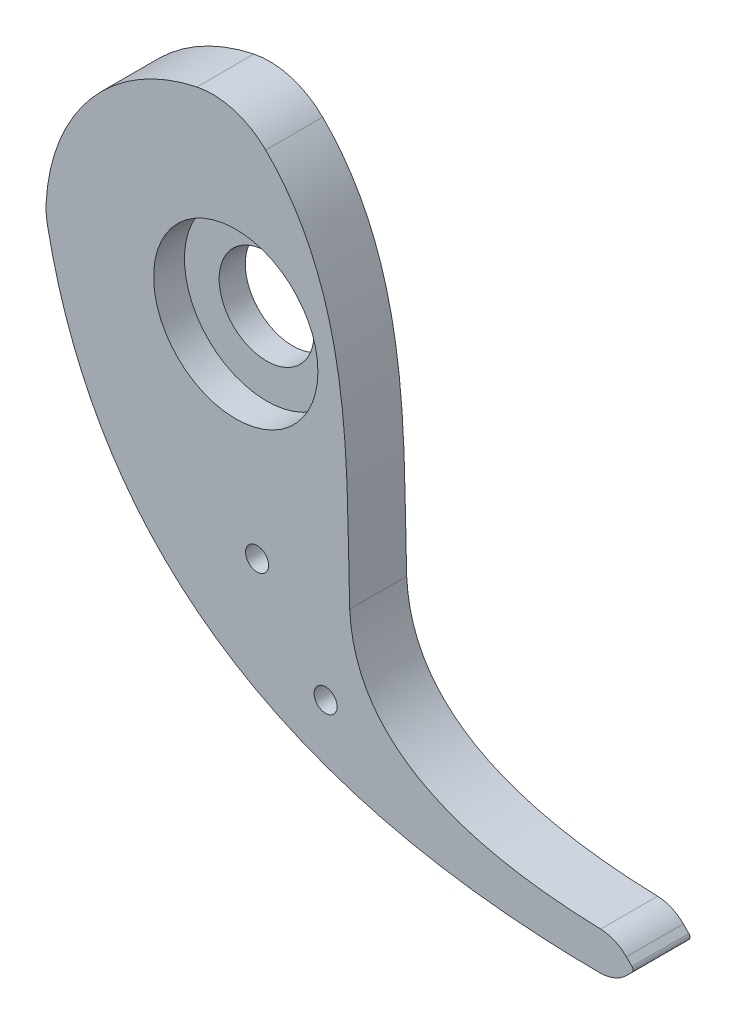
ISO-10303-21;
HEADER;
FILE_DESCRIPTION(('STEP AP214'),'2;1');
FILE_NAME('part.step','',(''),(''),'','','');
FILE_SCHEMA(('AUTOMOTIVE_DESIGN { 1 0 10303 214 1 1 1 1 }'));
ENDSEC;
DATA;
#1=APPLICATION_CONTEXT('core data for automotive mechanical design processes');
#2=APPLICATION_PROTOCOL_DEFINITION('international standard','automotive_design',2000,#1);
#3=PRODUCT_CONTEXT('',#1,'mechanical');
#4=PRODUCT('Part','Part','',(#3));
#5=PRODUCT_RELATED_PRODUCT_CATEGORY('part','',(#4));
#6=PRODUCT_DEFINITION_FORMATION('','',#4);
#7=PRODUCT_DEFINITION_CONTEXT('part definition',#1,'design');
#8=PRODUCT_DEFINITION('design','',#6,#7);
#9=PRODUCT_DEFINITION_SHAPE('','',#8);
#10=(LENGTH_UNIT() NAMED_UNIT(*) SI_UNIT(.MILLI.,.METRE.));
#11=(NAMED_UNIT(*) PLANE_ANGLE_UNIT() SI_UNIT($,.RADIAN.));
#12=(NAMED_UNIT(*) SI_UNIT($,.STERADIAN.) SOLID_ANGLE_UNIT());
#13=UNCERTAINTY_MEASURE_WITH_UNIT(LENGTH_MEASURE(1.E-05),#10,'distance_accuracy_value','');
#14=(GEOMETRIC_REPRESENTATION_CONTEXT(3) GLOBAL_UNCERTAINTY_ASSIGNED_CONTEXT((#13)) GLOBAL_UNIT_ASSIGNED_CONTEXT((#10,
#11,#12)) REPRESENTATION_CONTEXT('',''));
#15=CARTESIAN_POINT('',(0.,0.,0.));
#16=DIRECTION('',(0.,0.,1.));
#17=DIRECTION('',(1.,0.,0.));
#18=AXIS2_PLACEMENT_3D('',#15,#16,#17);
#19=CARTESIAN_POINT('',(0.,0.,86.));
#20=DIRECTION('',(0.,0.,-1.));
#21=DIRECTION('',(1.,0.,0.));
#22=AXIS2_PLACEMENT_3D('',#19,#20,#21);
#23=CYLINDRICAL_SURFACE('',#22,12.5);
#24=CARTESIAN_POINT('',(0.,0.,76.88));
#25=DIRECTION('',(0.,0.,1.));
#26=DIRECTION('',(1.,0.,0.));
#27=AXIS2_PLACEMENT_3D('',#24,#25,#26);
#28=CIRCLE('',#27,12.5);
#29=CARTESIAN_POINT('',(12.5,0.,76.88));
#30=VERTEX_POINT('',#29);
#31=EDGE_CURVE('E37',#30,#30,#28,.F.);
#32=ORIENTED_EDGE('',*,*,#31,.F.);
#33=EDGE_LOOP('',(#32));
#34=FACE_BOUND('',#33,.T.);
#35=CARTESIAN_POINT('',(0.,0.,70.));
#36=DIRECTION('',(0.,0.,1.));
#37=DIRECTION('',(1.,0.,0.));
#38=AXIS2_PLACEMENT_3D('',#35,#36,#37);
#39=CIRCLE('',#38,12.5);
#40=CARTESIAN_POINT('',(12.5,0.,70.));
#41=VERTEX_POINT('',#40);
#42=EDGE_CURVE('E179',#41,#41,#39,.T.);
#43=ORIENTED_EDGE('',*,*,#42,.F.);
#44=EDGE_LOOP('',(#43));
#45=FACE_BOUND('',#44,.T.);
#46=ADVANCED_FACE('F32',(#34,#45),#23,.F.);
#47=CARTESIAN_POINT('',(96.0614321255408,-89.9222344491999,70.));
#48=CARTESIAN_POINT('',(74.6396324890567,-89.3105921557209,70.));
#49=CARTESIAN_POINT('',(42.207594165123,-82.0452441207387,70.));
#50=CARTESIAN_POINT('',(30.5986777387312,-62.6957691895991,70.));
#51=CARTESIAN_POINT('',(30.,-50.,70.));
#52=B_SPLINE_CURVE_WITH_KNOTS('',3,(#47,#48,#49,#50,#51),.UNSPECIFIED.,.F.,.F.,(4,1,4),
(0.0277647284146162,0.487449893921152,0.947135059427687),.UNSPECIFIED.);
#53=DIRECTION('',(0.,0.,1.));
#54=VECTOR('',#53,1.);
#55=SURFACE_OF_LINEAR_EXTRUSION('',#52,#54);
#56=DIRECTION('',(0.,0.,1.));
#57=VECTOR('',#56,1.);
#58=CARTESIAN_POINT('',(96.0614321255408,-89.9222344491999,70.));
#59=LINE('',#58,#57);
#60=CARTESIAN_POINT('',(96.0614321255408,-89.9222344491999,70.));
#61=VERTEX_POINT('',#60);
#62=CARTESIAN_POINT('',(96.0614321255408,-89.9222344491999,85.));
#63=VERTEX_POINT('',#62);
#64=EDGE_CURVE('E122',#61,#63,#59,.T.);
#65=ORIENTED_EDGE('',*,*,#64,.F.);
#66=CARTESIAN_POINT('',(30.,-50.,70.));
#67=VERTEX_POINT('',#66);
#68=EDGE_CURVE('E232',#61,#67,#52,.T.);
#69=ORIENTED_EDGE('',*,*,#68,.T.);
#70=DIRECTION('',(0.,0.,1.));
#71=VECTOR('',#70,1.);
#72=CARTESIAN_POINT('',(30.,-50.,70.));
#73=LINE('',#72,#71);
#74=CARTESIAN_POINT('',(30.,-50.,85.));
#75=VERTEX_POINT('',#74);
#76=EDGE_CURVE('E11',#67,#75,#73,.T.);
#77=ORIENTED_EDGE('',*,*,#76,.T.);
#78=CARTESIAN_POINT('',(96.0614321255408,-89.9222344491999,85.));
#79=CARTESIAN_POINT('',(74.6396324890567,-89.3105921557209,85.));
#80=CARTESIAN_POINT('',(42.207594165123,-82.0452441207387,85.));
#81=CARTESIAN_POINT('',(30.5986777387312,-62.6957691895991,85.));
#82=CARTESIAN_POINT('',(30.,-50.,85.));
#83=B_SPLINE_CURVE_WITH_KNOTS('',3,(#78,#79,#80,#81,#82),.UNSPECIFIED.,.F.,.F.,(4,1,4),
(0.0277647284146162,0.487449893921152,0.947135059427687),.UNSPECIFIED.);
#84=EDGE_CURVE('E226',#63,#75,#83,.T.);
#85=ORIENTED_EDGE('',*,*,#84,.F.);
#86=EDGE_LOOP('',(#65,#69,#77,#85));
#87=FACE_BOUND('',#86,.T.);
#88=ADVANCED_FACE('F34',(#87),#55,.T.);
#89=CARTESIAN_POINT('',(30.,-50.,70.));
#90=CARTESIAN_POINT('',(29.0655778584205,-23.9165926404982,70.));
#91=CARTESIAN_POINT('',(31.4518831291268,15.3536689120195,70.));
#92=CARTESIAN_POINT('',(10.553539900454,41.0011969030345,70.));
#93=CARTESIAN_POINT('',(7.88775097032687,43.6234763854406,70.));
#94=B_SPLINE_CURVE_WITH_KNOTS('',3,(#89,#90,#91,#92,#93),.UNSPECIFIED.,.F.,.F.,(4,1,4),(0.,
0.805376888640356,0.908560602925233),.UNSPECIFIED.);
#95=DIRECTION('',(0.,0.,1.));
#96=VECTOR('',#95,1.);
#97=SURFACE_OF_LINEAR_EXTRUSION('',#94,#96);
#98=ORIENTED_EDGE('',*,*,#76,.F.);
#99=CARTESIAN_POINT('',(7.88775097032687,43.6234763854406,70.));
#100=VERTEX_POINT('',#99);
#101=EDGE_CURVE('E241',#67,#100,#94,.T.);
#102=ORIENTED_EDGE('',*,*,#101,.T.);
#103=DIRECTION('',(0.,0.,1.));
#104=VECTOR('',#103,1.);
#105=CARTESIAN_POINT('',(7.88775097032687,43.6234763854406,70.));
#106=LINE('',#105,#104);
#107=CARTESIAN_POINT('',(7.88775097032688,43.6234763854406,85.));
#108=VERTEX_POINT('',#107);
#109=EDGE_CURVE('E42',#100,#108,#106,.T.);
#110=ORIENTED_EDGE('',*,*,#109,.T.);
#111=CARTESIAN_POINT('',(30.,-50.,85.));
#112=CARTESIAN_POINT('',(29.0655778584205,-23.9165926404982,85.));
#113=CARTESIAN_POINT('',(31.4518831291268,15.3536689120195,85.));
#114=CARTESIAN_POINT('',(10.553539900454,41.0011969030345,85.));
#115=CARTESIAN_POINT('',(7.88775097032687,43.6234763854406,85.));
#116=B_SPLINE_CURVE_WITH_KNOTS('',3,(#111,#112,#113,#114,#115),.UNSPECIFIED.,.F.,.F.,(4,1,4),
(0.,0.805376888640356,0.908560602925233),.UNSPECIFIED.);
#117=EDGE_CURVE('E221',#75,#108,#116,.T.);
#118=ORIENTED_EDGE('',*,*,#117,.F.);
#119=EDGE_LOOP('',(#98,#102,#110,#118));
#120=FACE_BOUND('',#119,.T.);
#121=ADVANCED_FACE('F255',(#120),#97,.T.);
#122=CARTESIAN_POINT('',(-6.13755051397834,29.3654639617419,70.));
#123=DIRECTION('',(0.,0.,1.));
#124=DIRECTION('',(-1.,0.,0.));
#125=AXIS2_PLACEMENT_3D('',#122,#123,#124);
#126=CYLINDRICAL_SURFACE('',#125,20.);
#127=ORIENTED_EDGE('',*,*,#109,.F.);
#128=CARTESIAN_POINT('',(-6.13755051397834,29.3654639617419,70.));
#129=DIRECTION('',(0.,0.,1.));
#130=DIRECTION('',(1.,0.,0.));
#131=AXIS2_PLACEMENT_3D('',#128,#129,#130);
#132=CIRCLE('',#131,20.);
#133=CARTESIAN_POINT('',(-10.2292508566306,48.9424399362366,70.));
#134=VERTEX_POINT('',#133);
#135=EDGE_CURVE('E250',#100,#134,#132,.T.);
#136=ORIENTED_EDGE('',*,*,#135,.T.);
#137=DIRECTION('',(0.,0.,1.));
#138=VECTOR('',#137,1.);
#139=CARTESIAN_POINT('',(-10.2292508566306,48.9424399362366,70.));
#140=LINE('',#139,#138);
#141=CARTESIAN_POINT('',(-10.2292508566306,48.9424399362366,85.));
#142=VERTEX_POINT('',#141);
#143=EDGE_CURVE('E157',#134,#142,#140,.T.);
#144=ORIENTED_EDGE('',*,*,#143,.T.);
#145=CARTESIAN_POINT('',(-6.13755051397834,29.3654639617419,85.));
#146=DIRECTION('',(0.,0.,1.));
#147=DIRECTION('',(1.,0.,0.));
#148=AXIS2_PLACEMENT_3D('',#145,#146,#147);
#149=CIRCLE('',#148,20.);
#150=EDGE_CURVE('E218',#108,#142,#149,.T.);
#151=ORIENTED_EDGE('',*,*,#150,.F.);
#152=EDGE_LOOP('',(#127,#136,#144,#151));
#153=FACE_BOUND('',#152,.T.);
#154=ADVANCED_FACE('F258',(#153),#126,.T.);
#155=CARTESIAN_POINT('',(0.,0.,70.));
#156=DIRECTION('',(0.,0.,1.));
#157=DIRECTION('',(-1.,0.,0.));
#158=AXIS2_PLACEMENT_3D('',#155,#156,#157);
#159=CYLINDRICAL_SURFACE('',#158,50.);
#160=ORIENTED_EDGE('',*,*,#143,.F.);
#161=CARTESIAN_POINT('',(0.,0.,70.));
#162=DIRECTION('',(0.,0.,1.));
#163=DIRECTION('',(1.,0.,0.));
#164=AXIS2_PLACEMENT_3D('',#161,#162,#163);
#165=CIRCLE('',#164,50.);
#166=CARTESIAN_POINT('',(-49.9267220496655,2.70599803685169,70.));
#167=VERTEX_POINT('',#166);
#168=EDGE_CURVE('E311',#134,#167,#165,.T.);
#169=ORIENTED_EDGE('',*,*,#168,.T.);
#170=DIRECTION('',(0.,0.,1.));
#171=VECTOR('',#170,1.);
#172=CARTESIAN_POINT('',(-49.9267220496655,2.70599803685169,70.));
#173=LINE('',#172,#171);
#174=CARTESIAN_POINT('',(-49.9267220496655,2.70599803685169,85.));
#175=VERTEX_POINT('',#174);
#176=EDGE_CURVE('E154',#167,#175,#173,.T.);
#177=ORIENTED_EDGE('',*,*,#176,.T.);
#178=CARTESIAN_POINT('',(0.,0.,85.));
#179=DIRECTION('',(0.,0.,1.));
#180=DIRECTION('',(1.,0.,0.));
#181=AXIS2_PLACEMENT_3D('',#178,#179,#180);
#182=CIRCLE('',#181,50.);
#183=EDGE_CURVE('E215',#142,#175,#182,.T.);
#184=ORIENTED_EDGE('',*,*,#183,.F.);
#185=EDGE_LOOP('',(#160,#169,#177,#184));
#186=FACE_BOUND('',#185,.T.);
#187=ADVANCED_FACE('F262',(#186),#159,.T.);
#188=CARTESIAN_POINT('',(-29.9560332297993,1.62359882211103,70.));
#189=DIRECTION('',(0.,0.,1.));
#190=DIRECTION('',(-1.,0.,0.));
#191=AXIS2_PLACEMENT_3D('',#188,#189,#190);
#192=CYLINDRICAL_SURFACE('',#191,20.);
#193=ORIENTED_EDGE('',*,*,#176,.F.);
#194=CARTESIAN_POINT('',(-29.9560332297993,1.62359882211103,70.));
#195=DIRECTION('',(0.,0.,1.));
#196=DIRECTION('',(-1.,0.,0.));
#197=AXIS2_PLACEMENT_3D('',#194,#195,#196);
#198=CIRCLE('',#197,20.);
#199=CARTESIAN_POINT('',(-49.5860072797543,-2.20577694922468,70.));
#200=VERTEX_POINT('',#199);
#201=EDGE_CURVE('E286',#167,#200,#198,.T.);
#202=ORIENTED_EDGE('',*,*,#201,.T.);
#203=DIRECTION('',(0.,0.,1.));
#204=VECTOR('',#203,1.);
#205=CARTESIAN_POINT('',(-49.5860072797543,-2.20577694922468,70.));
#206=LINE('',#205,#204);
#207=CARTESIAN_POINT('',(-49.5860072797543,-2.20577694922467,85.));
#208=VERTEX_POINT('',#207);
#209=EDGE_CURVE('E151',#200,#208,#206,.T.);
#210=ORIENTED_EDGE('',*,*,#209,.T.);
#211=CARTESIAN_POINT('',(-29.9560332297993,1.62359882211103,85.));
#212=DIRECTION('',(0.,0.,1.));
#213=DIRECTION('',(1.,0.,0.));
#214=AXIS2_PLACEMENT_3D('',#211,#212,#213);
#215=CIRCLE('',#214,20.);
#216=EDGE_CURVE('E209',#175,#208,#215,.T.);
#217=ORIENTED_EDGE('',*,*,#216,.F.);
#218=EDGE_LOOP('',(#193,#202,#210,#217));
#219=FACE_BOUND('',#218,.T.);
#220=ADVANCED_FACE('F266',(#219),#192,.T.);
#221=CARTESIAN_POINT('',(-49.5860072797543,-2.20577694922467,70.));
#222=CARTESIAN_POINT('',(-47.0447095065424,-15.2328634302042,70.));
#223=CARTESIAN_POINT('',(-27.0452536153668,-73.5633104074933,70.));
#224=CARTESIAN_POINT('',(28.6366700505365,-99.6569197690937,70.));
#225=CARTESIAN_POINT('',(95.8012423090635,-100.004707302185,70.));
#226=B_SPLINE_CURVE_WITH_KNOTS('',3,(#221,#222,#223,#224,#225),.UNSPECIFIED.,.F.,.F.,(4,1,4),
(0.0110398117893649,0.207725041354784,0.983937689400536),.UNSPECIFIED.);
#227=DIRECTION('',(0.,0.,1.));
#228=VECTOR('',#227,1.);
#229=SURFACE_OF_LINEAR_EXTRUSION('',#226,#228);
#230=ORIENTED_EDGE('',*,*,#209,.F.);
#231=CARTESIAN_POINT('',(95.8012423090635,-100.004707302185,70.));
#232=VERTEX_POINT('',#231);
#233=EDGE_CURVE('E278',#200,#232,#226,.T.);
#234=ORIENTED_EDGE('',*,*,#233,.T.);
#235=DIRECTION('',(0.,0.,1.));
#236=VECTOR('',#235,1.);
#237=CARTESIAN_POINT('',(95.8012423090635,-100.004707302185,70.));
#238=LINE('',#237,#236);
#239=CARTESIAN_POINT('',(95.8012423090635,-100.004707302185,85.));
#240=VERTEX_POINT('',#239);
#241=EDGE_CURVE('E148',#232,#240,#238,.T.);
#242=ORIENTED_EDGE('',*,*,#241,.T.);
#243=CARTESIAN_POINT('',(-49.5860072797543,-2.20577694922467,85.));
#244=CARTESIAN_POINT('',(-47.0447095065424,-15.2328634302042,85.));
#245=CARTESIAN_POINT('',(-27.0452536153668,-73.5633104074933,85.));
#246=CARTESIAN_POINT('',(28.6366700505365,-99.6569197690937,85.));
#247=CARTESIAN_POINT('',(95.8012423090635,-100.004707302185,85.));
#248=B_SPLINE_CURVE_WITH_KNOTS('',3,(#243,#244,#245,#246,#247),.UNSPECIFIED.,.F.,.F.,(4,1,4),
(0.0110398117893649,0.207725041354784,0.983937689400536),.UNSPECIFIED.);
#249=EDGE_CURVE('E204',#208,#240,#248,.T.);
#250=ORIENTED_EDGE('',*,*,#249,.F.);
#251=EDGE_LOOP('',(#230,#234,#242,#250));
#252=FACE_BOUND('',#251,.T.);
#253=ADVANCED_FACE('F270',(#252),#229,.T.);
#254=CARTESIAN_POINT('',(95.8530230111228,-90.0048413651389,70.));
#255=DIRECTION('',(0.,0.,1.));
#256=DIRECTION('',(-1.,0.,0.));
#257=AXIS2_PLACEMENT_3D('',#254,#255,#256);
#258=CYLINDRICAL_SURFACE('',#257,10.);
#259=ORIENTED_EDGE('',*,*,#241,.F.);
#260=CARTESIAN_POINT('',(95.8530230111228,-90.0048413651389,70.));
#261=DIRECTION('',(0.,0.,1.));
#262=DIRECTION('',(-1.,0.,0.));
#263=AXIS2_PLACEMENT_3D('',#260,#261,#262);
#264=CIRCLE('',#263,10.);
#265=CARTESIAN_POINT('',(102.924090822988,-97.0759091770044,70.));
#266=VERTEX_POINT('',#265);
#267=EDGE_CURVE('E285',#232,#266,#264,.T.);
#268=ORIENTED_EDGE('',*,*,#267,.T.);
#269=DIRECTION('',(0.,0.,1.));
#270=VECTOR('',#269,1.);
#271=CARTESIAN_POINT('',(102.924090822988,-97.0759091770044,70.));
#272=LINE('',#271,#270);
#273=CARTESIAN_POINT('',(102.924090822988,-97.0759091770044,85.));
#274=VERTEX_POINT('',#273);
#275=EDGE_CURVE('E145',#266,#274,#272,.T.);
#276=ORIENTED_EDGE('',*,*,#275,.T.);
#277=CARTESIAN_POINT('',(95.8530230111228,-90.0048413651389,85.));
#278=DIRECTION('',(0.,0.,1.));
#279=DIRECTION('',(1.,0.,0.));
#280=AXIS2_PLACEMENT_3D('',#277,#278,#279);
#281=CIRCLE('',#280,10.);
#282=EDGE_CURVE('E201',#240,#274,#281,.T.);
#283=ORIENTED_EDGE('',*,*,#282,.F.);
#284=EDGE_LOOP('',(#259,#268,#276,#283));
#285=FACE_BOUND('',#284,.T.);
#286=ADVANCED_FACE('F275',(#285),#258,.T.);
#287=CARTESIAN_POINT('',(102.924090822988,-97.0759091770044,70.));
#288=DIRECTION('',(-0.707106781186551,0.707106781186544,0.));
#289=DIRECTION('',(-0.707106781186544,-0.707106781186551,0.));
#290=AXIS2_PLACEMENT_3D('',#287,#288,#289);
#291=PLANE('',#290);
#292=ORIENTED_EDGE('',*,*,#275,.F.);
#293=DIRECTION('',(0.707106781186544,0.707106781186551,0.));
#294=VECTOR('',#293,1.);
#295=CARTESIAN_POINT('',(102.924090822988,-97.0759091770044,70.));
#296=LINE('',#295,#294);
#297=CARTESIAN_POINT('',(104.29289321881,-95.7071067811829,70.));
#298=VERTEX_POINT('',#297);
#299=EDGE_CURVE('E292',#266,#298,#296,.T.);
#300=ORIENTED_EDGE('',*,*,#299,.T.);
#301=DIRECTION('',(0.,0.,1.));
#302=VECTOR('',#301,1.);
#303=CARTESIAN_POINT('',(104.29289321881,-95.7071067811829,70.));
#304=LINE('',#303,#302);
#305=CARTESIAN_POINT('',(104.29289321881,-95.7071067811829,85.));
#306=VERTEX_POINT('',#305);
#307=EDGE_CURVE('E138',#298,#306,#304,.T.);
#308=ORIENTED_EDGE('',*,*,#307,.T.);
#309=DIRECTION('',(0.707106781186544,0.707106781186551,0.));
#310=VECTOR('',#309,1.);
#311=CARTESIAN_POINT('',(102.924090822988,-97.0759091770044,85.));
#312=LINE('',#311,#310);
#313=EDGE_CURVE('E199',#274,#306,#312,.T.);
#314=ORIENTED_EDGE('',*,*,#313,.F.);
#315=EDGE_LOOP('',(#292,#300,#308,#314));
#316=FACE_BOUND('',#315,.T.);
#317=ADVANCED_FACE('F318',(#316),#291,.F.);
#318=CARTESIAN_POINT('',(103.585786437623,-94.9999999999963,70.));
#319=DIRECTION('',(0.,0.,1.));
#320=DIRECTION('',(-1.,0.,0.));
#321=AXIS2_PLACEMENT_3D('',#318,#319,#320);
#322=CYLINDRICAL_SURFACE('',#321,0.999999999999997);
#323=ORIENTED_EDGE('',*,*,#307,.F.);
#324=CARTESIAN_POINT('',(103.585786437623,-94.9999999999963,70.));
#325=DIRECTION('',(0.,0.,1.));
#326=DIRECTION('',(-1.,0.,0.));
#327=AXIS2_PLACEMENT_3D('',#324,#325,#326);
#328=CIRCLE('',#327,0.999999999999997);
#329=CARTESIAN_POINT('',(104.29289321881,-94.2928932188098,70.));
#330=VERTEX_POINT('',#329);
#331=EDGE_CURVE('E295',#298,#330,#328,.T.);
#332=ORIENTED_EDGE('',*,*,#331,.T.);
#333=DIRECTION('',(0.,0.,1.));
#334=VECTOR('',#333,1.);
#335=CARTESIAN_POINT('',(104.29289321881,-94.2928932188098,70.));
#336=LINE('',#335,#334);
#337=CARTESIAN_POINT('',(104.29289321881,-94.2928932188098,85.));
#338=VERTEX_POINT('',#337);
#339=EDGE_CURVE('E136',#330,#338,#336,.T.);
#340=ORIENTED_EDGE('',*,*,#339,.T.);
#341=CARTESIAN_POINT('',(103.585786437623,-94.9999999999963,85.));
#342=DIRECTION('',(0.,0.,1.));
#343=DIRECTION('',(1.,0.,0.));
#344=AXIS2_PLACEMENT_3D('',#341,#342,#343);
#345=CIRCLE('',#344,0.999999999999997);
#346=EDGE_CURVE('E129',#306,#338,#345,.T.);
#347=ORIENTED_EDGE('',*,*,#346,.F.);
#348=EDGE_LOOP('',(#323,#332,#340,#347));
#349=FACE_BOUND('',#348,.T.);
#350=ADVANCED_FACE('F300',(#349),#322,.T.);
#351=CARTESIAN_POINT('',(102.84709295017,-92.8470929501699,70.));
#352=DIRECTION('',(-0.707106781186548,-0.707106781186548,0.));
#353=DIRECTION('',(0.707106781186548,-0.707106781186548,0.));
#354=AXIS2_PLACEMENT_3D('',#351,#352,#353);
#355=PLANE('',#354);
#356=ORIENTED_EDGE('',*,*,#339,.F.);
#357=DIRECTION('',(-0.707106781186548,0.707106781186548,0.));
#358=VECTOR('',#357,1.);
#359=CARTESIAN_POINT('',(102.84709295017,-92.8470929501699,70.));
#360=LINE('',#359,#358);
#361=CARTESIAN_POINT('',(102.84709295017,-92.8470929501699,70.));
#362=VERTEX_POINT('',#361);
#363=EDGE_CURVE('E135',#330,#362,#360,.T.);
#364=ORIENTED_EDGE('',*,*,#363,.T.);
#365=DIRECTION('',(0.,0.,1.));
#366=VECTOR('',#365,1.);
#367=CARTESIAN_POINT('',(102.84709295017,-92.8470929501699,70.));
#368=LINE('',#367,#366);
#369=CARTESIAN_POINT('',(102.84709295017,-92.8470929501699,85.));
#370=VERTEX_POINT('',#369);
#371=EDGE_CURVE('E119',#362,#370,#368,.T.);
#372=ORIENTED_EDGE('',*,*,#371,.T.);
#373=DIRECTION('',(-0.707106781186548,0.707106781186548,0.));
#374=VECTOR('',#373,1.);
#375=CARTESIAN_POINT('',(102.84709295017,-92.8470929501699,85.));
#376=LINE('',#375,#374);
#377=EDGE_CURVE('E123',#338,#370,#376,.T.);
#378=ORIENTED_EDGE('',*,*,#377,.F.);
#379=EDGE_LOOP('',(#356,#364,#372,#378));
#380=FACE_BOUND('',#379,.T.);
#381=ADVANCED_FACE('F134',(#380),#355,.F.);
#382=CARTESIAN_POINT('',(95.7760251383045,-99.9181607620354,70.));
#383=DIRECTION('',(0.,0.,1.));
#384=DIRECTION('',(-1.,0.,0.));
#385=AXIS2_PLACEMENT_3D('',#382,#383,#384);
#386=CYLINDRICAL_SURFACE('',#385,10.);
#387=ORIENTED_EDGE('',*,*,#371,.F.);
#388=CARTESIAN_POINT('',(95.7760251383045,-99.9181607620354,70.));
#389=DIRECTION('',(0.,0.,1.));
#390=DIRECTION('',(1.,0.,0.));
#391=AXIS2_PLACEMENT_3D('',#388,#389,#390);
#392=CIRCLE('',#391,10.);
#393=EDGE_CURVE('E58',#362,#61,#392,.T.);
#394=ORIENTED_EDGE('',*,*,#393,.T.);
#395=ORIENTED_EDGE('',*,*,#64,.T.);
#396=CARTESIAN_POINT('',(95.7760251383045,-99.9181607620354,85.));
#397=DIRECTION('',(0.,0.,1.));
#398=DIRECTION('',(1.,0.,0.));
#399=AXIS2_PLACEMENT_3D('',#396,#397,#398);
#400=CIRCLE('',#399,10.);
#401=EDGE_CURVE('E50',#370,#63,#400,.T.);
#402=ORIENTED_EDGE('',*,*,#401,.F.);
#403=EDGE_LOOP('',(#387,#394,#395,#402));
#404=FACE_BOUND('',#403,.T.);
#405=ADVANCED_FACE('F117',(#404),#386,.T.);
#406=CARTESIAN_POINT('',(47.4133746395084,-79.0242123966994,70.));
#407=DIRECTION('',(0.,0.,-1.));
#408=DIRECTION('',(1.,0.,0.));
#409=AXIS2_PLACEMENT_3D('',#406,#407,#408);
#410=PLANE('',#409);
#411=CARTESIAN_POINT('',(23.6513180824392,-73.9138117802537,70.));
#412=DIRECTION('',(0.,0.,1.));
#413=DIRECTION('',(1.,0.,0.));
#414=AXIS2_PLACEMENT_3D('',#411,#412,#413);
#415=CIRCLE('',#414,5.05);
#416=CARTESIAN_POINT('',(28.7013180824392,-73.9138117802537,70.));
#417=VERTEX_POINT('',#416);
#418=EDGE_CURVE('E124',#417,#417,#415,.F.);
#419=ORIENTED_EDGE('',*,*,#418,.F.);
#420=EDGE_LOOP('',(#419));
#421=FACE_BOUND('',#420,.T.);
#422=CARTESIAN_POINT('',(5.62196341020624,-50.7014980743151,70.));
#423=DIRECTION('',(0.,0.,1.));
#424=DIRECTION('',(1.,0.,0.));
#425=AXIS2_PLACEMENT_3D('',#422,#423,#424);
#426=CIRCLE('',#425,5.05);
#427=CARTESIAN_POINT('',(10.6666689251155,-50.932682563078,70.));
#428=VERTEX_POINT('',#427);
#429=EDGE_CURVE('E169',#428,#428,#426,.F.);
#430=ORIENTED_EDGE('',*,*,#429,.F.);
#431=EDGE_LOOP('',(#430));
#432=FACE_BOUND('',#431,.T.);
#433=ORIENTED_EDGE('',*,*,#68,.F.);
#434=ORIENTED_EDGE('',*,*,#393,.F.);
#435=ORIENTED_EDGE('',*,*,#363,.F.);
#436=ORIENTED_EDGE('',*,*,#331,.F.);
#437=ORIENTED_EDGE('',*,*,#299,.F.);
#438=ORIENTED_EDGE('',*,*,#267,.F.);
#439=ORIENTED_EDGE('',*,*,#233,.F.);
#440=ORIENTED_EDGE('',*,*,#201,.F.);
#441=ORIENTED_EDGE('',*,*,#168,.F.);
#442=ORIENTED_EDGE('',*,*,#135,.F.);
#443=ORIENTED_EDGE('',*,*,#101,.F.);
#444=EDGE_LOOP('',(#433,#434,#435,#436,#437,#438,#439,#440,#441,#442,#443));
#445=FACE_BOUND('',#444,.T.);
#446=ORIENTED_EDGE('',*,*,#42,.T.);
#447=EDGE_LOOP('',(#446));
#448=FACE_BOUND('',#447,.T.);
#449=ADVANCED_FACE('F302',(#421,#432,#445,#448),#410,.T.);
#450=CARTESIAN_POINT('',(0.,0.,85.));
#451=DIRECTION('',(0.,0.,-1.));
#452=DIRECTION('',(1.,0.,0.));
#453=AXIS2_PLACEMENT_3D('',#450,#451,#452);
#454=PLANE('',#453);
#455=CARTESIAN_POINT('',(0.,0.,85.));
#456=DIRECTION('',(0.,0.,1.));
#457=DIRECTION('',(1.,0.,0.));
#458=AXIS2_PLACEMENT_3D('',#455,#456,#457);
#459=CIRCLE('',#458,21.63);
#460=CARTESIAN_POINT('',(21.63,0.,85.));
#461=VERTEX_POINT('',#460);
#462=EDGE_CURVE('E173',#461,#461,#459,.F.);
#463=ORIENTED_EDGE('',*,*,#462,.T.);
#464=EDGE_LOOP('',(#463));
#465=FACE_BOUND('',#464,.T.);
#466=CARTESIAN_POINT('',(23.6513180824392,-73.9138117802537,85.));
#467=DIRECTION('',(0.,0.,1.));
#468=DIRECTION('',(1.,0.,0.));
#469=AXIS2_PLACEMENT_3D('',#466,#467,#468);
#470=CIRCLE('',#469,3.03);
#471=CARTESIAN_POINT('',(26.6813180824392,-73.9138117802537,85.));
#472=VERTEX_POINT('',#471);
#473=EDGE_CURVE('E165',#472,#472,#470,.F.);
#474=ORIENTED_EDGE('',*,*,#473,.T.);
#475=EDGE_LOOP('',(#474));
#476=FACE_BOUND('',#475,.T.);
#477=CARTESIAN_POINT('',(5.62196341020624,-50.7014980743151,85.));
#478=DIRECTION('',(0.,0.,1.));
#479=DIRECTION('',(1.,0.,0.));
#480=AXIS2_PLACEMENT_3D('',#477,#478,#479);
#481=CIRCLE('',#480,3.03);
#482=CARTESIAN_POINT('',(8.64878671915177,-50.8402087675728,85.));
#483=VERTEX_POINT('',#482);
#484=EDGE_CURVE('E162',#483,#483,#481,.F.);
#485=ORIENTED_EDGE('',*,*,#484,.T.);
#486=EDGE_LOOP('',(#485));
#487=FACE_BOUND('',#486,.T.);
#488=ORIENTED_EDGE('',*,*,#401,.T.);
#489=ORIENTED_EDGE('',*,*,#84,.T.);
#490=ORIENTED_EDGE('',*,*,#117,.T.);
#491=ORIENTED_EDGE('',*,*,#150,.T.);
#492=ORIENTED_EDGE('',*,*,#183,.T.);
#493=ORIENTED_EDGE('',*,*,#216,.T.);
#494=ORIENTED_EDGE('',*,*,#249,.T.);
#495=ORIENTED_EDGE('',*,*,#282,.T.);
#496=ORIENTED_EDGE('',*,*,#313,.T.);
#497=ORIENTED_EDGE('',*,*,#346,.T.);
#498=ORIENTED_EDGE('',*,*,#377,.T.);
#499=EDGE_LOOP('',(#488,#489,#490,#491,#492,#493,#494,#495,#496,#497,#498));
#500=FACE_BOUND('',#499,.T.);
#501=ADVANCED_FACE('F127',(#465,#476,#487,#500),#454,.F.);
#502=CARTESIAN_POINT('',(5.62196341020624,-50.7014980743151,155.365915538227));
#503=DIRECTION('',(0.,0.,-1.));
#504=DIRECTION('',(0.998951587110736,-0.04577910668572,0.));
#505=AXIS2_PLACEMENT_3D('',#502,#503,#504);
#506=CYLINDRICAL_SURFACE('',#505,3.03);
#507=CARTESIAN_POINT('',(5.62196341020624,-50.7014980743151,79.6159155382273));
#508=DIRECTION('',(0.,0.,-1.));
#509=DIRECTION('',(-0.998951587110736,0.04577910668572,0.));
#510=AXIS2_PLACEMENT_3D('',#507,#508,#509);
#511=CIRCLE('',#510,3.03);
#512=CARTESIAN_POINT('',(8.64878671915177,-50.8402087675728,79.6159155382273));
#513=VERTEX_POINT('',#512);
#514=EDGE_CURVE('E193',#513,#513,#511,.T.);
#515=CARTESIAN_POINT('',(8.64878671915177,-50.8402087675728,79.6159155382273));
#516=CARTESIAN_POINT('',(8.64878671915177,-50.8402087675728,79.6719997513707));
#517=CARTESIAN_POINT('',(8.64878671915177,-50.8402087675728,79.7280839645142));
#518=CARTESIAN_POINT('',(8.64878671915177,-50.8402087675728,79.8402523908011));
#519=CARTESIAN_POINT('',(8.64878671915177,-50.8402087675728,79.8963366039446));
#520=CARTESIAN_POINT('',(8.64878671915177,-50.8402087675728,80.0085050302315));
#521=CARTESIAN_POINT('',(8.64878671915177,-50.8402087675728,80.064589243375));
#522=CARTESIAN_POINT('',(8.64878671915177,-50.8402087675728,80.1767576696619));
#523=CARTESIAN_POINT('',(8.64878671915177,-50.8402087675728,80.2328418828054));
#524=CARTESIAN_POINT('',(8.64878671915177,-50.8402087675728,80.3450103090923));
#525=CARTESIAN_POINT('',(8.64878671915177,-50.8402087675728,80.4010945222358));
#526=CARTESIAN_POINT('',(8.64878671915177,-50.8402087675728,80.5132629485227));
#527=CARTESIAN_POINT('',(8.64878671915177,-50.8402087675728,80.5693471616662));
#528=CARTESIAN_POINT('',(8.64878671915177,-50.8402087675728,80.6815155879531));
#529=CARTESIAN_POINT('',(8.64878671915177,-50.8402087675728,80.7375998010966));
#530=CARTESIAN_POINT('',(8.64878671915177,-50.8402087675728,80.8497682273835));
#531=CARTESIAN_POINT('',(8.64878671915177,-50.8402087675728,80.905852440527));
#532=CARTESIAN_POINT('',(8.64878671915177,-50.8402087675728,81.0180208668139));
#533=CARTESIAN_POINT('',(8.64878671915177,-50.8402087675728,81.0741050799574));
#534=CARTESIAN_POINT('',(8.64878671915177,-50.8402087675728,81.1862735062443));
#535=CARTESIAN_POINT('',(8.64878671915177,-50.8402087675728,81.2423577193878));
#536=CARTESIAN_POINT('',(8.64878671915177,-50.8402087675728,81.3545261456747));
#537=CARTESIAN_POINT('',(8.64878671915177,-50.8402087675728,81.4106103588182));
#538=CARTESIAN_POINT('',(8.64878671915177,-50.8402087675728,81.5227787851051));
#539=CARTESIAN_POINT('',(8.64878671915177,-50.8402087675728,81.5788629982486));
#540=CARTESIAN_POINT('',(8.64878671915177,-50.8402087675728,81.6910314245355));
#541=CARTESIAN_POINT('',(8.64878671915177,-50.8402087675728,81.747115637679));
#542=CARTESIAN_POINT('',(8.64878671915177,-50.8402087675728,81.8592840639659));
#543=CARTESIAN_POINT('',(8.64878671915177,-50.8402087675728,81.9153682771094));
#544=CARTESIAN_POINT('',(8.64878671915177,-50.8402087675728,82.0275367033963));
#545=CARTESIAN_POINT('',(8.64878671915177,-50.8402087675728,82.0836209165398));
#546=CARTESIAN_POINT('',(8.64878671915177,-50.8402087675728,82.1957893428267));
#547=CARTESIAN_POINT('',(8.64878671915177,-50.8402087675728,82.2518735559702));
#548=CARTESIAN_POINT('',(8.64878671915177,-50.8402087675728,82.3640419822571));
#549=CARTESIAN_POINT('',(8.64878671915177,-50.8402087675728,82.4201261954006));
#550=CARTESIAN_POINT('',(8.64878671915177,-50.8402087675728,82.5322946216875));
#551=CARTESIAN_POINT('',(8.64878671915177,-50.8402087675728,82.588378834831));
#552=CARTESIAN_POINT('',(8.64878671915177,-50.8402087675728,82.7005472611179));
#553=CARTESIAN_POINT('',(8.64878671915177,-50.8402087675728,82.7566314742614));
#554=CARTESIAN_POINT('',(8.64878671915177,-50.8402087675728,82.8687999005483));
#555=CARTESIAN_POINT('',(8.64878671915177,-50.8402087675728,82.9248841136918));
#556=CARTESIAN_POINT('',(8.64878671915177,-50.8402087675728,83.0370525399787));
#557=CARTESIAN_POINT('',(8.64878671915177,-50.8402087675728,83.0931367531222));
#558=CARTESIAN_POINT('',(8.64878671915177,-50.8402087675728,83.2053051794091));
#559=CARTESIAN_POINT('',(8.64878671915177,-50.8402087675728,83.2613893925526));
#560=CARTESIAN_POINT('',(8.64878671915177,-50.8402087675728,83.3735578188395));
#561=CARTESIAN_POINT('',(8.64878671915177,-50.8402087675728,83.429642031983));
#562=CARTESIAN_POINT('',(8.64878671915177,-50.8402087675728,83.5418104582699));
#563=CARTESIAN_POINT('',(8.64878671915177,-50.8402087675728,83.5978946714133));
#564=CARTESIAN_POINT('',(8.64878671915177,-50.8402087675728,83.7100630977003));
#565=CARTESIAN_POINT('',(8.64878671915177,-50.8402087675728,83.7661473108437));
#566=CARTESIAN_POINT('',(8.64878671915177,-50.8402087675728,83.8783157371307));
#567=CARTESIAN_POINT('',(8.64878671915177,-50.8402087675728,83.9343999502742));
#568=CARTESIAN_POINT('',(8.64878671915177,-50.8402087675728,84.0465683765611));
#569=CARTESIAN_POINT('',(8.64878671915177,-50.8402087675728,84.1026525897045));
#570=CARTESIAN_POINT('',(8.64878671915177,-50.8402087675728,84.2148210159915));
#571=CARTESIAN_POINT('',(8.64878671915177,-50.8402087675728,84.2709052291349));
#572=CARTESIAN_POINT('',(8.64878671915177,-50.8402087675728,84.3830736554219));
#573=CARTESIAN_POINT('',(8.64878671915177,-50.8402087675728,84.4391578685653));
#574=CARTESIAN_POINT('',(8.64878671915177,-50.8402087675728,84.5513262948523));
#575=CARTESIAN_POINT('',(8.64878671915177,-50.8402087675728,84.6074105079958));
#576=CARTESIAN_POINT('',(8.64878671915177,-50.8402087675728,84.7195789342827));
#577=CARTESIAN_POINT('',(8.64878671915177,-50.8402087675728,84.7756631474261));
#578=CARTESIAN_POINT('',(8.64878671915177,-50.8402087675728,84.8878315737131));
#579=CARTESIAN_POINT('',(8.64878671915177,-50.8402087675728,84.9439157868565));
#580=CARTESIAN_POINT('',(8.64878671915177,-50.8402087675728,85.));
#581=B_SPLINE_CURVE_WITH_KNOTS('',3,(#515,#516,#517,#518,#519,#520,#521,#522,#523,#524,#525,
#526,#527,#528,#529,#530,#531,#532,#533,#534,#535,#536,#537,#538,#539,#540,#541,#542,#543,#544,
#545,#546,#547,#548,#549,#550,#551,#552,#553,#554,#555,#556,#557,#558,#559,#560,#561,#562,#563,
#564,#565,#566,#567,#568,#569,#570,#571,#572,#573,#574,#575,#576,#577,#578,#579,#580),
.UNSPECIFIED.,.F.,.F.,(4,2,2,2,2,2,2,2,2,2,2,2,2,2,2,2,2,2,2,2,2,2,2,2,2,2,2,2,2,2,2,2,4),(0.,
0.168252639430405,0.336505278860796,0.504757918291188,0.673010557721593,0.841263197151998,
1.00951583658239,1.17776847601278,1.34602111544319,1.51427375487359,1.68252639430398,
1.85077903373437,2.01903167316478,2.18728431259518,2.35553695202557,2.52378959145597,
2.69204223088637,2.86029487031678,3.02854750974717,3.19680014917756,3.36505278860796,
3.53330542803837,3.70155806746876,3.86981070689915,4.03806334632956,4.20631598575996,
4.37456862519035,4.54282126462074,4.71107390405115,4.87932654348155,5.04757918291195,
5.21583182234234,5.38408446177274),.UNSPECIFIED.);
#582=EDGE_CURVE('BSEAM351',#513,#483,#581,.T.);
#583=ORIENTED_EDGE('',*,*,#514,.T.);
#584=ORIENTED_EDGE('',*,*,#484,.F.);
#585=ORIENTED_EDGE('',*,*,#582,.T.);
#586=ORIENTED_EDGE('',*,*,#582,.F.);
#587=EDGE_LOOP('',(#583,#585,#584,#586));
#588=FACE_BOUND('',#587,.T.);
#589=ADVANCED_FACE('F351',(#588),#506,.F.);
#590=CARTESIAN_POINT('',(5.62196341020624,-50.7014980743151,79.6159155382273));
#591=DIRECTION('',(0.,0.,-1.));
#592=DIRECTION('',(0.998951587110736,-0.04577910668572,0.));
#593=AXIS2_PLACEMENT_3D('',#590,#591,#592);
#594=CYLINDRICAL_SURFACE('',#593,5.05);
#595=CARTESIAN_POINT('',(5.62196341020624,-50.7014980743151,79.6159155382273));
#596=DIRECTION('',(0.,0.,-1.));
#597=DIRECTION('',(-0.998951587110736,0.04577910668572,0.));
#598=AXIS2_PLACEMENT_3D('',#595,#596,#597);
#599=CIRCLE('',#598,5.05);
#600=CARTESIAN_POINT('',(10.6666689251155,-50.932682563078,79.6159155382273));
#601=VERTEX_POINT('',#600);
#602=EDGE_CURVE('E187',#601,#601,#599,.T.);
#603=CARTESIAN_POINT('',(10.6666689251155,-50.932682563078,70.));
#604=CARTESIAN_POINT('',(10.6666689251155,-50.932682563078,70.1001657868565));
#605=CARTESIAN_POINT('',(10.6666689251155,-50.932682563078,70.2003315737131));
#606=CARTESIAN_POINT('',(10.6666689251155,-50.932682563078,70.4006631474261));
#607=CARTESIAN_POINT('',(10.6666689251155,-50.932682563078,70.5008289342827));
#608=CARTESIAN_POINT('',(10.6666689251155,-50.932682563078,70.7011605079957));
#609=CARTESIAN_POINT('',(10.6666689251155,-50.932682563078,70.8013262948523));
#610=CARTESIAN_POINT('',(10.6666689251155,-50.932682563078,71.0016578685653));
#611=CARTESIAN_POINT('',(10.6666689251155,-50.932682563078,71.1018236554219));
#612=CARTESIAN_POINT('',(10.6666689251155,-50.932682563078,71.3021552291349));
#613=CARTESIAN_POINT('',(10.6666689251155,-50.932682563078,71.4023210159915));
#614=CARTESIAN_POINT('',(10.6666689251155,-50.932682563078,71.6026525897045));
#615=CARTESIAN_POINT('',(10.6666689251155,-50.932682563078,71.7028183765611));
#616=CARTESIAN_POINT('',(10.6666689251155,-50.932682563078,71.9031499502742));
#617=CARTESIAN_POINT('',(10.6666689251155,-50.932682563078,72.0033157371307));
#618=CARTESIAN_POINT('',(10.6666689251155,-50.932682563078,72.2036473108437));
#619=CARTESIAN_POINT('',(10.6666689251155,-50.932682563078,72.3038130977003));
#620=CARTESIAN_POINT('',(10.6666689251155,-50.932682563078,72.5041446714133));
#621=CARTESIAN_POINT('',(10.6666689251155,-50.932682563078,72.6043104582699));
#622=CARTESIAN_POINT('',(10.6666689251155,-50.932682563078,72.804642031983));
#623=CARTESIAN_POINT('',(10.6666689251155,-50.932682563078,72.9048078188395));
#624=CARTESIAN_POINT('',(10.6666689251155,-50.932682563078,73.1051393925526));
#625=CARTESIAN_POINT('',(10.6666689251155,-50.932682563078,73.2053051794091));
#626=CARTESIAN_POINT('',(10.6666689251155,-50.932682563078,73.4056367531222));
#627=CARTESIAN_POINT('',(10.6666689251155,-50.932682563078,73.5058025399787));
#628=CARTESIAN_POINT('',(10.6666689251155,-50.932682563078,73.7061341136918));
#629=CARTESIAN_POINT('',(10.6666689251155,-50.932682563078,73.8062999005483));
#630=CARTESIAN_POINT('',(10.6666689251155,-50.932682563078,74.0066314742614));
#631=CARTESIAN_POINT('',(10.6666689251155,-50.932682563078,74.1067972611179));
#632=CARTESIAN_POINT('',(10.6666689251155,-50.932682563078,74.3071288348309));
#633=CARTESIAN_POINT('',(10.6666689251155,-50.932682563078,74.4072946216875));
#634=CARTESIAN_POINT('',(10.6666689251155,-50.932682563078,74.6076261954006));
#635=CARTESIAN_POINT('',(10.6666689251155,-50.932682563078,74.7077919822571));
#636=CARTESIAN_POINT('',(10.6666689251155,-50.932682563078,74.9081235559702));
#637=CARTESIAN_POINT('',(10.6666689251155,-50.932682563078,75.0082893428267));
#638=CARTESIAN_POINT('',(10.6666689251155,-50.932682563078,75.2086209165398));
#639=CARTESIAN_POINT('',(10.6666689251155,-50.932682563078,75.3087867033963));
#640=CARTESIAN_POINT('',(10.6666689251155,-50.932682563078,75.5091182771094));
#641=CARTESIAN_POINT('',(10.6666689251155,-50.932682563078,75.6092840639659));
#642=CARTESIAN_POINT('',(10.6666689251155,-50.932682563078,75.809615637679));
#643=CARTESIAN_POINT('',(10.6666689251155,-50.932682563078,75.9097814245355));
#644=CARTESIAN_POINT('',(10.6666689251155,-50.932682563078,76.1101129982486));
#645=CARTESIAN_POINT('',(10.6666689251155,-50.932682563078,76.2102787851051));
#646=CARTESIAN_POINT('',(10.6666689251155,-50.932682563078,76.4106103588182));
#647=CARTESIAN_POINT('',(10.6666689251155,-50.932682563078,76.5107761456747));
#648=CARTESIAN_POINT('',(10.6666689251155,-50.932682563078,76.7111077193878));
#649=CARTESIAN_POINT('',(10.6666689251155,-50.932682563078,76.8112735062443));
#650=CARTESIAN_POINT('',(10.6666689251155,-50.932682563078,77.0116050799574));
#651=CARTESIAN_POINT('',(10.6666689251155,-50.932682563078,77.1117708668139));
#652=CARTESIAN_POINT('',(10.6666689251155,-50.932682563078,77.312102440527));
#653=CARTESIAN_POINT('',(10.6666689251155,-50.932682563078,77.4122682273835));
#654=CARTESIAN_POINT('',(10.6666689251155,-50.932682563078,77.6125998010966));
#655=CARTESIAN_POINT('',(10.6666689251155,-50.932682563078,77.7127655879531));
#656=CARTESIAN_POINT('',(10.6666689251155,-50.932682563078,77.9130971616662));
#657=CARTESIAN_POINT('',(10.6666689251155,-50.932682563078,78.0132629485227));
#658=CARTESIAN_POINT('',(10.6666689251155,-50.932682563078,78.2135945222358));
#659=CARTESIAN_POINT('',(10.6666689251155,-50.932682563078,78.3137603090923));
#660=CARTESIAN_POINT('',(10.6666689251155,-50.932682563078,78.5140918828054));
#661=CARTESIAN_POINT('',(10.6666689251155,-50.932682563078,78.6142576696619));
#662=CARTESIAN_POINT('',(10.6666689251155,-50.932682563078,78.814589243375));
#663=CARTESIAN_POINT('',(10.6666689251155,-50.932682563078,78.9147550302315));
#664=CARTESIAN_POINT('',(10.6666689251155,-50.932682563078,79.1150866039446));
#665=CARTESIAN_POINT('',(10.6666689251155,-50.932682563078,79.2152523908011));
#666=CARTESIAN_POINT('',(10.6666689251155,-50.932682563078,79.4155839645142));
#667=CARTESIAN_POINT('',(10.6666689251155,-50.932682563078,79.5157497513707));
#668=CARTESIAN_POINT('',(10.6666689251155,-50.932682563078,79.6159155382273));
#669=B_SPLINE_CURVE_WITH_KNOTS('',3,(#603,#604,#605,#606,#607,#608,#609,#610,#611,#612,#613,
#614,#615,#616,#617,#618,#619,#620,#621,#622,#623,#624,#625,#626,#627,#628,#629,#630,#631,#632,
#633,#634,#635,#636,#637,#638,#639,#640,#641,#642,#643,#644,#645,#646,#647,#648,#649,#650,#651,
#652,#653,#654,#655,#656,#657,#658,#659,#660,#661,#662,#663,#664,#665,#666,#667,#668),
.UNSPECIFIED.,.F.,.F.,(4,2,2,2,2,2,2,2,2,2,2,2,2,2,2,2,2,2,2,2,2,2,2,2,2,2,2,2,2,2,2,2,4),(0.,
0.300497360569613,0.600994721139211,0.90149208170881,1.20198944227841,1.50248680284802,
1.80298416341762,2.10348152398722,2.40397888455682,2.70447624512642,3.00497360569603,
3.30547096626563,3.60596832683523,3.90646568740483,4.20696304797442,4.50746040854404,
4.80795776911364,5.10845512968323,5.40895249025283,5.70944985082245,6.00994721139204,
6.31044457196164,6.61094193253124,6.91143929310084,7.21193665367045,7.51243401424005,
7.81293137480965,8.11342873537925,8.41392609594886,8.71442345651846,9.01492081708806,
9.31541817765766,9.61591553822726),.UNSPECIFIED.);
#670=EDGE_CURVE('BSEAM354',#428,#601,#669,.T.);
#671=ORIENTED_EDGE('',*,*,#429,.T.);
#672=ORIENTED_EDGE('',*,*,#602,.F.);
#673=ORIENTED_EDGE('',*,*,#670,.T.);
#674=ORIENTED_EDGE('',*,*,#670,.F.);
#675=EDGE_LOOP('',(#671,#673,#672,#674));
#676=FACE_BOUND('',#675,.T.);
#677=ADVANCED_FACE('F354',(#676),#594,.F.);
#678=CARTESIAN_POINT('',(5.62196341020624,-50.7014980743151,79.6159155382273));
#679=DIRECTION('',(0.,0.,1.));
#680=DIRECTION('',(-0.998951587110736,0.04577910668572,0.));
#681=AXIS2_PLACEMENT_3D('',#678,#679,#680);
#682=PLANE('',#681);
#683=ORIENTED_EDGE('',*,*,#514,.F.);
#684=EDGE_LOOP('',(#683));
#685=FACE_BOUND('',#684,.T.);
#686=ORIENTED_EDGE('',*,*,#602,.T.);
#687=EDGE_LOOP('',(#686));
#688=FACE_BOUND('',#687,.T.);
#689=ADVANCED_FACE('F341',(#685,#688),#682,.F.);
#690=CARTESIAN_POINT('',(23.6513180824392,-73.9138117802537,155.365915538227));
#691=DIRECTION('',(0.,0.,-1.));
#692=DIRECTION('',(0.96066085551831,0.277724180932861,0.));
#693=AXIS2_PLACEMENT_3D('',#690,#691,#692);
#694=CYLINDRICAL_SURFACE('',#693,3.03);
#695=CARTESIAN_POINT('',(23.6513180824392,-73.9138117802537,79.6159155382273));
#696=DIRECTION('',(0.,0.,-1.));
#697=DIRECTION('',(-0.96066085551831,-0.277724180932861,0.));
#698=AXIS2_PLACEMENT_3D('',#695,#696,#697);
#699=CIRCLE('',#698,3.03);
#700=CARTESIAN_POINT('',(20.7405156902187,-74.7553160484803,79.6159155382273));
#701=VERTEX_POINT('',#700);
#702=EDGE_CURVE('E166',#701,#701,#699,.T.);
#703=ORIENTED_EDGE('',*,*,#702,.T.);
#704=EDGE_LOOP('',(#703));
#705=FACE_BOUND('',#704,.T.);
#706=ORIENTED_EDGE('',*,*,#473,.F.);
#707=EDGE_LOOP('',(#706));
#708=FACE_BOUND('',#707,.T.);
#709=ADVANCED_FACE('F337',(#705,#708),#694,.F.);
#710=CARTESIAN_POINT('',(23.6513180824392,-73.9138117802537,79.6159155382273));
#711=DIRECTION('',(0.,0.,-1.));
#712=DIRECTION('',(0.96066085551831,0.277724180932861,0.));
#713=AXIS2_PLACEMENT_3D('',#710,#711,#712);
#714=CYLINDRICAL_SURFACE('',#713,5.05);
#715=ORIENTED_EDGE('',*,*,#418,.T.);
#716=EDGE_LOOP('',(#715));
#717=FACE_BOUND('',#716,.T.);
#718=CARTESIAN_POINT('',(23.6513180824392,-73.9138117802537,79.6159155382273));
#719=DIRECTION('',(0.,0.,-1.));
#720=DIRECTION('',(-0.96066085551831,-0.277724180932861,0.));
#721=AXIS2_PLACEMENT_3D('',#718,#719,#720);
#722=CIRCLE('',#721,5.05);
#723=CARTESIAN_POINT('',(18.7999807620718,-75.3163188939647,79.6159155382273));
#724=VERTEX_POINT('',#723);
#725=EDGE_CURVE('E190',#724,#724,#722,.T.);
#726=ORIENTED_EDGE('',*,*,#725,.F.);
#727=EDGE_LOOP('',(#726));
#728=FACE_BOUND('',#727,.T.);
#729=ADVANCED_FACE('F340',(#717,#728),#714,.F.);
#730=CARTESIAN_POINT('',(23.6513180824392,-73.9138117802537,79.6159155382273));
#731=DIRECTION('',(0.,0.,1.));
#732=DIRECTION('',(-0.96066085551831,-0.277724180932861,0.));
#733=AXIS2_PLACEMENT_3D('',#730,#731,#732);
#734=PLANE('',#733);
#735=ORIENTED_EDGE('',*,*,#702,.F.);
#736=EDGE_LOOP('',(#735));
#737=FACE_BOUND('',#736,.T.);
#738=ORIENTED_EDGE('',*,*,#725,.T.);
#739=EDGE_LOOP('',(#738));
#740=FACE_BOUND('',#739,.T.);
#741=ADVANCED_FACE('F343',(#737,#740),#734,.F.);
#742=CARTESIAN_POINT('',(0.,0.,76.88));
#743=DIRECTION('',(0.,0.,-1.));
#744=DIRECTION('',(1.,0.,0.));
#745=AXIS2_PLACEMENT_3D('',#742,#743,#744);
#746=PLANE('',#745);
#747=CARTESIAN_POINT('',(0.,0.,76.88));
#748=DIRECTION('',(0.,0.,1.));
#749=DIRECTION('',(1.,0.,0.));
#750=AXIS2_PLACEMENT_3D('',#747,#748,#749);
#751=CIRCLE('',#750,21.63);
#752=CARTESIAN_POINT('',(21.63,0.,76.88));
#753=VERTEX_POINT('',#752);
#754=EDGE_CURVE('E175',#753,#753,#751,.T.);
#755=ORIENTED_EDGE('',*,*,#754,.T.);
#756=EDGE_LOOP('',(#755));
#757=FACE_BOUND('',#756,.T.);
#758=ORIENTED_EDGE('',*,*,#31,.T.);
#759=EDGE_LOOP('',(#758));
#760=FACE_BOUND('',#759,.T.);
#761=ADVANCED_FACE('F346',(#757,#760),#746,.F.);
#762=CARTESIAN_POINT('',(0.,0.,76.88));
#763=DIRECTION('',(0.,0.,1.));
#764=DIRECTION('',(-1.,0.,0.));
#765=AXIS2_PLACEMENT_3D('',#762,#763,#764);
#766=CYLINDRICAL_SURFACE('',#765,21.63);
#767=ORIENTED_EDGE('',*,*,#754,.F.);
#768=EDGE_LOOP('',(#767));
#769=FACE_BOUND('',#768,.T.);
#770=ORIENTED_EDGE('',*,*,#462,.F.);
#771=EDGE_LOOP('',(#770));
#772=FACE_BOUND('',#771,.T.);
#773=ADVANCED_FACE('F335',(#769,#772),#766,.F.);
#774=CLOSED_SHELL('',(#46,#88,#121,#154,#187,#220,#253,#286,#317,#350,#381,#405,#449,#501,#589,
#677,#689,#709,#729,#741,#761,#773));
#775=MANIFOLD_SOLID_BREP('B2',#774);
#776=ADVANCED_BREP_SHAPE_REPRESENTATION('',(#18,#775),#14);
#777=SHAPE_DEFINITION_REPRESENTATION(#9,#776);
ENDSEC;
END-ISO-10303-21;
